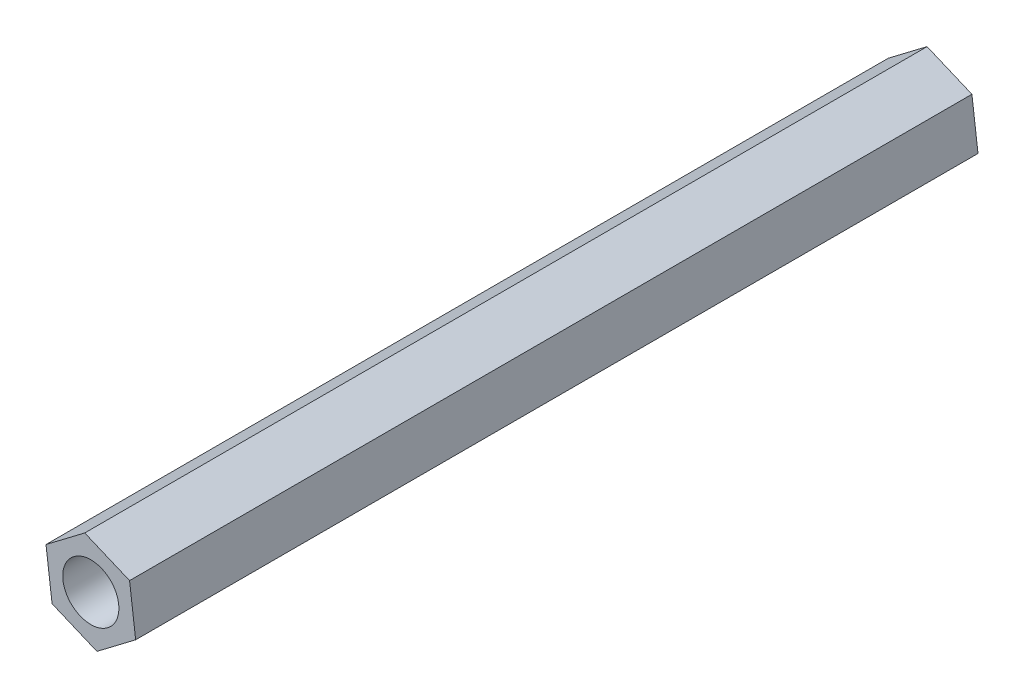
ISO-10303-21;
HEADER;
FILE_DESCRIPTION(('STEP AP214'),'2;1');
FILE_NAME('part.step','',(''),(''),'','','');
FILE_SCHEMA(('AUTOMOTIVE_DESIGN { 1 0 10303 214 1 1 1 1 }'));
ENDSEC;
DATA;
#1=APPLICATION_CONTEXT('core data for automotive mechanical design processes');
#2=APPLICATION_PROTOCOL_DEFINITION('international standard','automotive_design',2000,#1);
#3=PRODUCT_CONTEXT('',#1,'mechanical');
#4=PRODUCT('Part','Part','',(#3));
#5=PRODUCT_RELATED_PRODUCT_CATEGORY('part','',(#4));
#6=PRODUCT_DEFINITION_FORMATION('','',#4);
#7=PRODUCT_DEFINITION_CONTEXT('part definition',#1,'design');
#8=PRODUCT_DEFINITION('design','',#6,#7);
#9=PRODUCT_DEFINITION_SHAPE('','',#8);
#10=(LENGTH_UNIT() NAMED_UNIT(*) SI_UNIT(.MILLI.,.METRE.));
#11=(NAMED_UNIT(*) PLANE_ANGLE_UNIT() SI_UNIT($,.RADIAN.));
#12=(NAMED_UNIT(*) SI_UNIT($,.STERADIAN.) SOLID_ANGLE_UNIT());
#13=UNCERTAINTY_MEASURE_WITH_UNIT(LENGTH_MEASURE(1.E-05),#10,'distance_accuracy_value','');
#14=(GEOMETRIC_REPRESENTATION_CONTEXT(3) GLOBAL_UNCERTAINTY_ASSIGNED_CONTEXT((#13)) GLOBAL_UNIT_ASSIGNED_CONTEXT((#10,
#11,#12)) REPRESENTATION_CONTEXT('',''));
#15=CARTESIAN_POINT('',(0.,0.,0.));
#16=DIRECTION('',(0.,0.,1.));
#17=DIRECTION('',(1.,0.,0.));
#18=AXIS2_PLACEMENT_3D('',#15,#16,#17);
#19=CARTESIAN_POINT('',(3.19306920327228,-1.34324571955921,60.));
#20=DIRECTION('',(-0.9921481202619,-0.125068411122787,0.));
#21=DIRECTION('',(0.125068411122787,-0.9921481202619,0.));
#22=AXIS2_PLACEMENT_3D('',#19,#20,#21);
#23=PLANE('',#22);
#24=DIRECTION('',(-0.125068411122787,0.9921481202619,0.));
#25=VECTOR('',#24,1.);
#26=CARTESIAN_POINT('',(3.19306920327228,-1.34324571955921,0.));
#27=LINE('',#26,#25);
#28=CARTESIAN_POINT('',(3.19306920327228,-1.34324571955921,0.));
#29=VERTEX_POINT('',#28);
#30=CARTESIAN_POINT('',(2.75981951829912,2.09365618629593,0.));
#31=VERTEX_POINT('',#30);
#32=EDGE_CURVE('E125',#29,#31,#27,.T.);
#33=ORIENTED_EDGE('',*,*,#32,.T.);
#34=DIRECTION('',(0.,0.,-1.));
#35=VECTOR('',#34,1.);
#36=CARTESIAN_POINT('',(2.75981951829912,2.09365618629593,60.));
#37=LINE('',#36,#35);
#38=CARTESIAN_POINT('',(2.75981951829912,2.09365618629593,60.));
#39=VERTEX_POINT('',#38);
#40=EDGE_CURVE('E11',#39,#31,#37,.T.);
#41=ORIENTED_EDGE('',*,*,#40,.F.);
#42=DIRECTION('',(-0.125068411122787,0.9921481202619,0.));
#43=VECTOR('',#42,1.);
#44=CARTESIAN_POINT('',(3.19306920327228,-1.34324571955921,60.));
#45=LINE('',#44,#43);
#46=CARTESIAN_POINT('',(3.19306920327228,-1.34324571955921,60.));
#47=VERTEX_POINT('',#46);
#48=EDGE_CURVE('E136',#47,#39,#45,.T.);
#49=ORIENTED_EDGE('',*,*,#48,.F.);
#50=DIRECTION('',(0.,0.,-1.));
#51=VECTOR('',#50,1.);
#52=CARTESIAN_POINT('',(3.19306920327228,-1.34324571955921,60.));
#53=LINE('',#52,#51);
#54=EDGE_CURVE('E121',#47,#29,#53,.T.);
#55=ORIENTED_EDGE('',*,*,#54,.T.);
#56=EDGE_LOOP('',(#33,#41,#49,#55));
#57=FACE_BOUND('',#56,.T.);
#58=ADVANCED_FACE('F41',(#57),#23,.F.);
#59=CARTESIAN_POINT('',(2.75981951829912,2.09365618629593,60.));
#60=DIRECTION('',(-0.38776163888766,-0.921759682025177,0.));
#61=DIRECTION('',(0.921759682025177,-0.38776163888766,0.));
#62=AXIS2_PLACEMENT_3D('',#59,#60,#61);
#63=PLANE('',#62);
#64=DIRECTION('',(-0.921759682025177,0.38776163888766,0.));
#65=VECTOR('',#64,1.);
#66=CARTESIAN_POINT('',(2.75981951829912,2.09365618629593,0.));
#67=LINE('',#66,#65);
#68=CARTESIAN_POINT('',(-0.433249684973158,3.43690190585513,0.));
#69=VERTEX_POINT('',#68);
#70=EDGE_CURVE('E128',#31,#69,#67,.T.);
#71=ORIENTED_EDGE('',*,*,#70,.T.);
#72=DIRECTION('',(0.,0.,-1.));
#73=VECTOR('',#72,1.);
#74=CARTESIAN_POINT('',(-0.433249684973158,3.43690190585513,60.));
#75=LINE('',#74,#73);
#76=CARTESIAN_POINT('',(-0.433249684973158,3.43690190585513,60.));
#77=VERTEX_POINT('',#76);
#78=EDGE_CURVE('E49',#77,#69,#75,.T.);
#79=ORIENTED_EDGE('',*,*,#78,.F.);
#80=DIRECTION('',(-0.921759682025177,0.38776163888766,0.));
#81=VECTOR('',#80,1.);
#82=CARTESIAN_POINT('',(2.75981951829912,2.09365618629593,60.));
#83=LINE('',#82,#81);
#84=EDGE_CURVE('E94',#39,#77,#83,.T.);
#85=ORIENTED_EDGE('',*,*,#84,.F.);
#86=ORIENTED_EDGE('',*,*,#40,.T.);
#87=EDGE_LOOP('',(#71,#79,#85,#86));
#88=FACE_BOUND('',#87,.T.);
#89=ADVANCED_FACE('F162',(#88),#63,.F.);
#90=CARTESIAN_POINT('',(-0.433249684973158,3.43690190585513,60.));
#91=DIRECTION('',(0.60438648137424,-0.79669127090239,0.));
#92=DIRECTION('',(0.79669127090239,0.60438648137424,0.));
#93=AXIS2_PLACEMENT_3D('',#90,#91,#92);
#94=PLANE('',#93);
#95=DIRECTION('',(-0.79669127090239,-0.60438648137424,0.));
#96=VECTOR('',#95,1.);
#97=CARTESIAN_POINT('',(-0.433249684973158,3.43690190585513,0.));
#98=LINE('',#97,#96);
#99=CARTESIAN_POINT('',(-3.19306920327228,1.34324571955921,0.));
#100=VERTEX_POINT('',#99);
#101=EDGE_CURVE('E131',#69,#100,#98,.T.);
#102=ORIENTED_EDGE('',*,*,#101,.T.);
#103=DIRECTION('',(0.,0.,-1.));
#104=VECTOR('',#103,1.);
#105=CARTESIAN_POINT('',(-3.19306920327228,1.34324571955921,60.));
#106=LINE('',#105,#104);
#107=CARTESIAN_POINT('',(-3.19306920327228,1.34324571955921,60.));
#108=VERTEX_POINT('',#107);
#109=EDGE_CURVE('E116',#108,#100,#106,.T.);
#110=ORIENTED_EDGE('',*,*,#109,.F.);
#111=DIRECTION('',(-0.79669127090239,-0.60438648137424,0.));
#112=VECTOR('',#111,1.);
#113=CARTESIAN_POINT('',(-0.433249684973158,3.43690190585513,60.));
#114=LINE('',#113,#112);
#115=EDGE_CURVE('E107',#77,#108,#114,.T.);
#116=ORIENTED_EDGE('',*,*,#115,.F.);
#117=ORIENTED_EDGE('',*,*,#78,.T.);
#118=EDGE_LOOP('',(#102,#110,#116,#117));
#119=FACE_BOUND('',#118,.T.);
#120=ADVANCED_FACE('F142',(#119),#94,.F.);
#121=CARTESIAN_POINT('',(-3.19306920327228,1.34324571955921,60.));
#122=DIRECTION('',(0.9921481202619,0.125068411122787,0.));
#123=DIRECTION('',(-0.125068411122787,0.9921481202619,0.));
#124=AXIS2_PLACEMENT_3D('',#121,#122,#123);
#125=PLANE('',#124);
#126=DIRECTION('',(0.125068411122787,-0.9921481202619,0.));
#127=VECTOR('',#126,1.);
#128=CARTESIAN_POINT('',(-3.19306920327228,1.34324571955921,0.));
#129=LINE('',#128,#127);
#130=CARTESIAN_POINT('',(-2.75981951829912,-2.09365618629593,0.));
#131=VERTEX_POINT('',#130);
#132=EDGE_CURVE('E115',#100,#131,#129,.T.);
#133=ORIENTED_EDGE('',*,*,#132,.T.);
#134=DIRECTION('',(0.,0.,-1.));
#135=VECTOR('',#134,1.);
#136=CARTESIAN_POINT('',(-2.75981951829912,-2.09365618629593,60.));
#137=LINE('',#136,#135);
#138=CARTESIAN_POINT('',(-2.75981951829912,-2.09365618629593,60.));
#139=VERTEX_POINT('',#138);
#140=EDGE_CURVE('E112',#139,#131,#137,.T.);
#141=ORIENTED_EDGE('',*,*,#140,.F.);
#142=DIRECTION('',(0.125068411122787,-0.9921481202619,0.));
#143=VECTOR('',#142,1.);
#144=CARTESIAN_POINT('',(-3.19306920327228,1.34324571955921,60.));
#145=LINE('',#144,#143);
#146=EDGE_CURVE('E101',#108,#139,#145,.T.);
#147=ORIENTED_EDGE('',*,*,#146,.F.);
#148=ORIENTED_EDGE('',*,*,#109,.T.);
#149=EDGE_LOOP('',(#133,#141,#147,#148));
#150=FACE_BOUND('',#149,.T.);
#151=ADVANCED_FACE('F113',(#150),#125,.F.);
#152=CARTESIAN_POINT('',(-2.75981951829912,-2.09365618629593,60.));
#153=DIRECTION('',(0.38776163888766,0.921759682025177,0.));
#154=DIRECTION('',(-0.921759682025177,0.38776163888766,0.));
#155=AXIS2_PLACEMENT_3D('',#152,#153,#154);
#156=PLANE('',#155);
#157=DIRECTION('',(0.921759682025177,-0.38776163888766,0.));
#158=VECTOR('',#157,1.);
#159=CARTESIAN_POINT('',(-2.75981951829912,-2.09365618629593,0.));
#160=LINE('',#159,#158);
#161=CARTESIAN_POINT('',(0.433249684973159,-3.43690190585513,0.));
#162=VERTEX_POINT('',#161);
#163=EDGE_CURVE('E80',#131,#162,#160,.T.);
#164=ORIENTED_EDGE('',*,*,#163,.T.);
#165=DIRECTION('',(0.,0.,-1.));
#166=VECTOR('',#165,1.);
#167=CARTESIAN_POINT('',(0.433249684973159,-3.43690190585513,60.));
#168=LINE('',#167,#166);
#169=CARTESIAN_POINT('',(0.433249684973159,-3.43690190585513,60.));
#170=VERTEX_POINT('',#169);
#171=EDGE_CURVE('E117',#170,#162,#168,.T.);
#172=ORIENTED_EDGE('',*,*,#171,.F.);
#173=DIRECTION('',(0.921759682025177,-0.38776163888766,0.));
#174=VECTOR('',#173,1.);
#175=CARTESIAN_POINT('',(-2.75981951829912,-2.09365618629593,60.));
#176=LINE('',#175,#174);
#177=EDGE_CURVE('E105',#139,#170,#176,.T.);
#178=ORIENTED_EDGE('',*,*,#177,.F.);
#179=ORIENTED_EDGE('',*,*,#140,.T.);
#180=EDGE_LOOP('',(#164,#172,#178,#179));
#181=FACE_BOUND('',#180,.T.);
#182=ADVANCED_FACE('F119',(#181),#156,.F.);
#183=CARTESIAN_POINT('',(0.433249684973159,-3.43690190585513,60.));
#184=DIRECTION('',(-0.60438648137424,0.79669127090239,0.));
#185=DIRECTION('',(-0.79669127090239,-0.60438648137424,0.));
#186=AXIS2_PLACEMENT_3D('',#183,#184,#185);
#187=PLANE('',#186);
#188=DIRECTION('',(0.79669127090239,0.60438648137424,0.));
#189=VECTOR('',#188,1.);
#190=CARTESIAN_POINT('',(0.433249684973159,-3.43690190585513,0.));
#191=LINE('',#190,#189);
#192=EDGE_CURVE('E86',#162,#29,#191,.T.);
#193=ORIENTED_EDGE('',*,*,#192,.T.);
#194=ORIENTED_EDGE('',*,*,#54,.F.);
#195=DIRECTION('',(0.79669127090239,0.60438648137424,0.));
#196=VECTOR('',#195,1.);
#197=CARTESIAN_POINT('',(0.433249684973159,-3.43690190585513,60.));
#198=LINE('',#197,#196);
#199=EDGE_CURVE('E57',#170,#47,#198,.T.);
#200=ORIENTED_EDGE('',*,*,#199,.F.);
#201=ORIENTED_EDGE('',*,*,#171,.T.);
#202=EDGE_LOOP('',(#193,#194,#200,#201));
#203=FACE_BOUND('',#202,.T.);
#204=ADVANCED_FACE('F149',(#203),#187,.F.);
#205=CARTESIAN_POINT('',(0.,0.,60.));
#206=DIRECTION('',(0.,0.,1.));
#207=DIRECTION('',(1.,0.,0.));
#208=AXIS2_PLACEMENT_3D('',#205,#206,#207);
#209=PLANE('',#208);
#210=CARTESIAN_POINT('',(0.,0.,60.));
#211=DIRECTION('',(0.,0.,1.));
#212=DIRECTION('',(1.,0.,0.));
#213=AXIS2_PLACEMENT_3D('',#210,#211,#212);
#214=CIRCLE('',#213,2.);
#215=CARTESIAN_POINT('',(2.,0.,60.));
#216=VERTEX_POINT('',#215);
#217=EDGE_CURVE('E129',#216,#216,#214,.T.);
#218=ORIENTED_EDGE('',*,*,#217,.F.);
#219=EDGE_LOOP('',(#218));
#220=FACE_BOUND('',#219,.T.);
#221=ORIENTED_EDGE('',*,*,#48,.T.);
#222=ORIENTED_EDGE('',*,*,#84,.T.);
#223=ORIENTED_EDGE('',*,*,#115,.T.);
#224=ORIENTED_EDGE('',*,*,#146,.T.);
#225=ORIENTED_EDGE('',*,*,#177,.T.);
#226=ORIENTED_EDGE('',*,*,#199,.T.);
#227=EDGE_LOOP('',(#221,#222,#223,#224,#225,#226));
#228=FACE_BOUND('',#227,.T.);
#229=ADVANCED_FACE('F103',(#220,#228),#209,.T.);
#230=CARTESIAN_POINT('',(0.,0.,0.));
#231=DIRECTION('',(0.,0.,1.));
#232=DIRECTION('',(1.,0.,0.));
#233=AXIS2_PLACEMENT_3D('',#230,#231,#232);
#234=PLANE('',#233);
#235=CARTESIAN_POINT('',(0.,0.,0.));
#236=DIRECTION('',(0.,0.,1.));
#237=DIRECTION('',(1.,0.,0.));
#238=AXIS2_PLACEMENT_3D('',#235,#236,#237);
#239=CIRCLE('',#238,2.);
#240=CARTESIAN_POINT('',(2.,0.,0.));
#241=VERTEX_POINT('',#240);
#242=EDGE_CURVE('E266',#241,#241,#239,.T.);
#243=ORIENTED_EDGE('',*,*,#242,.T.);
#244=EDGE_LOOP('',(#243));
#245=FACE_BOUND('',#244,.T.);
#246=ORIENTED_EDGE('',*,*,#32,.F.);
#247=ORIENTED_EDGE('',*,*,#192,.F.);
#248=ORIENTED_EDGE('',*,*,#163,.F.);
#249=ORIENTED_EDGE('',*,*,#132,.F.);
#250=ORIENTED_EDGE('',*,*,#101,.F.);
#251=ORIENTED_EDGE('',*,*,#70,.F.);
#252=EDGE_LOOP('',(#246,#247,#248,#249,#250,#251));
#253=FACE_BOUND('',#252,.T.);
#254=ADVANCED_FACE('F145',(#245,#253),#234,.F.);
#255=CARTESIAN_POINT('',(0.,0.,0.));
#256=DIRECTION('',(0.,0.,1.));
#257=DIRECTION('',(1.,0.,0.));
#258=AXIS2_PLACEMENT_3D('',#255,#256,#257);
#259=CYLINDRICAL_SURFACE('',#258,2.);
#260=ORIENTED_EDGE('',*,*,#217,.T.);
#261=EDGE_LOOP('',(#260));
#262=FACE_BOUND('',#261,.T.);
#263=ORIENTED_EDGE('',*,*,#242,.F.);
#264=EDGE_LOOP('',(#263));
#265=FACE_BOUND('',#264,.T.);
#266=ADVANCED_FACE('F201',(#262,#265),#259,.F.);
#267=CLOSED_SHELL('',(#58,#89,#120,#151,#182,#204,#229,#254,#266));
#268=MANIFOLD_SOLID_BREP('B2',#267);
#269=ADVANCED_BREP_SHAPE_REPRESENTATION('',(#18,#268),#14);
#270=SHAPE_DEFINITION_REPRESENTATION(#9,#269);
ENDSEC;
END-ISO-10303-21;
